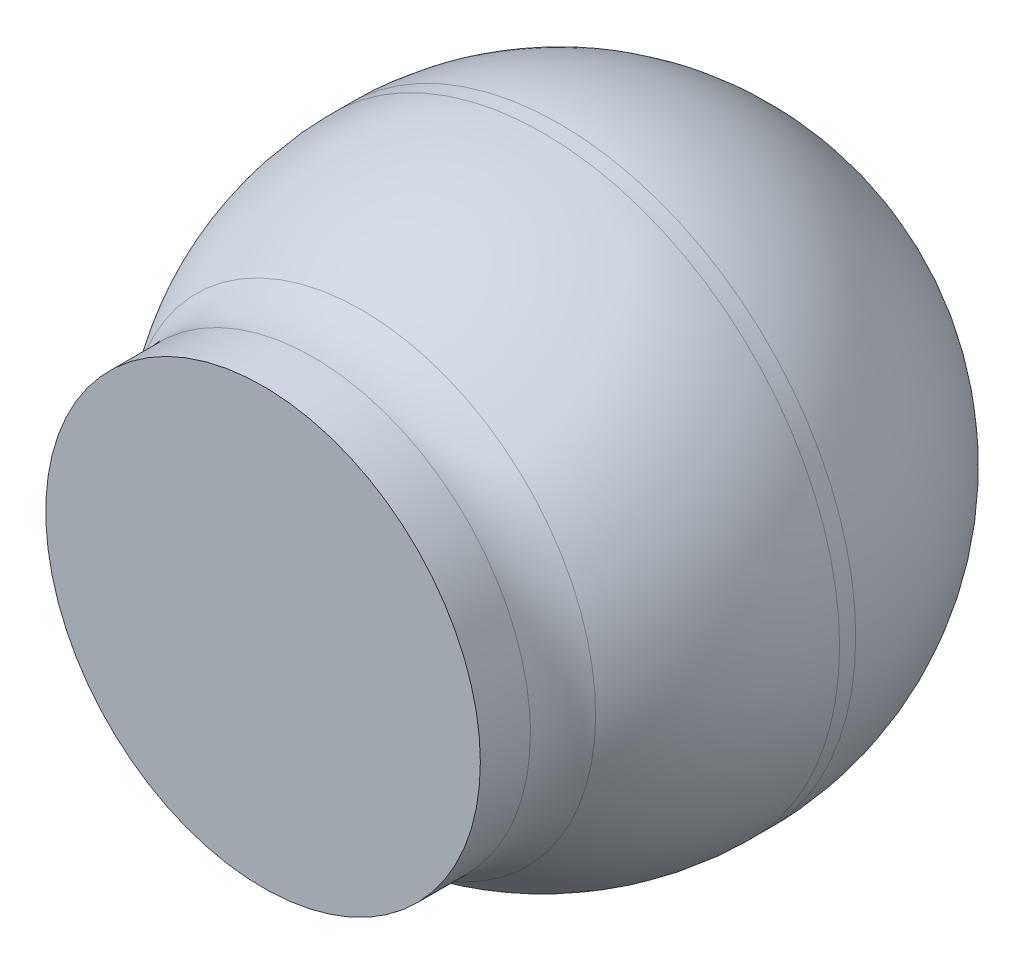
ISO-10303-21;
HEADER;
FILE_DESCRIPTION(('STEP AP214'),'2;1');
FILE_NAME('part.step','',(''),(''),'','','');
FILE_SCHEMA(('AUTOMOTIVE_DESIGN { 1 0 10303 214 1 1 1 1 }'));
ENDSEC;
DATA;
#1=APPLICATION_CONTEXT('core data for automotive mechanical design processes');
#2=APPLICATION_PROTOCOL_DEFINITION('international standard','automotive_design',2000,#1);
#3=PRODUCT_CONTEXT('',#1,'mechanical');
#4=PRODUCT('Part','Part','',(#3));
#5=PRODUCT_RELATED_PRODUCT_CATEGORY('part','',(#4));
#6=PRODUCT_DEFINITION_FORMATION('','',#4);
#7=PRODUCT_DEFINITION_CONTEXT('part definition',#1,'design');
#8=PRODUCT_DEFINITION('design','',#6,#7);
#9=PRODUCT_DEFINITION_SHAPE('','',#8);
#10=(LENGTH_UNIT() NAMED_UNIT(*) SI_UNIT(.MILLI.,.METRE.));
#11=(NAMED_UNIT(*) PLANE_ANGLE_UNIT() SI_UNIT($,.RADIAN.));
#12=(NAMED_UNIT(*) SI_UNIT($,.STERADIAN.) SOLID_ANGLE_UNIT());
#13=UNCERTAINTY_MEASURE_WITH_UNIT(LENGTH_MEASURE(1.E-05),#10,'distance_accuracy_value','');
#14=(GEOMETRIC_REPRESENTATION_CONTEXT(3) GLOBAL_UNCERTAINTY_ASSIGNED_CONTEXT((#13)) GLOBAL_UNIT_ASSIGNED_CONTEXT((#10,
#11,#12)) REPRESENTATION_CONTEXT('',''));
#15=CARTESIAN_POINT('',(0.,0.,0.));
#16=DIRECTION('',(0.,0.,1.));
#17=DIRECTION('',(1.,0.,0.));
#18=AXIS2_PLACEMENT_3D('',#15,#16,#17);
#19=CARTESIAN_POINT('',(-4.372919922269,-6.591349291452,10.006534503384));
#20=DIRECTION('',(0.,0.,-1.));
#21=DIRECTION('',(-1.,0.,0.));
#22=AXIS2_PLACEMENT_3D('',#19,#20,#21);
#23=PLANE('',#22);
#24=CARTESIAN_POINT('',(-4.372919922269,-6.591349291452,10.006534503384));
#25=DIRECTION('',(0.,0.,1.));
#26=DIRECTION('',(1.,0.,0.));
#27=AXIS2_PLACEMENT_3D('',#24,#25,#26);
#28=CIRCLE('',#27,0.275);
#29=CARTESIAN_POINT('',(-4.097919922269,-6.591349291452,10.006534503384));
#30=VERTEX_POINT('',#29);
#31=EDGE_CURVE('E20',#30,#30,#28,.F.);
#32=ORIENTED_EDGE('',*,*,#31,.F.);
#33=EDGE_LOOP('',(#32));
#34=FACE_BOUND('',#33,.T.);
#35=ADVANCED_FACE('F17',(#34),#23,.F.);
#36=CARTESIAN_POINT('',(-4.372919922269,-6.591349291452,9.906534503384));
#37=DIRECTION('',(0.,0.,1.));
#38=DIRECTION('',(1.,0.,0.));
#39=AXIS2_PLACEMENT_3D('',#36,#37,#38);
#40=CYLINDRICAL_SURFACE('',#39,0.275);
#41=CARTESIAN_POINT('',(-4.372919922269,-6.591349291452,9.943180457728));
#42=DIRECTION('',(0.,0.,-1.));
#43=DIRECTION('',(0.996700902337583,0.0811622527992439,0.));
#44=AXIS2_PLACEMENT_3D('',#41,#42,#43);
#45=CIRCLE('',#44,0.275);
#46=CARTESIAN_POINT('',(-4.09882717412617,-6.56902967193221,9.943180457728));
#47=VERTEX_POINT('',#46);
#48=EDGE_CURVE('E65',#47,#47,#45,.F.);
#49=ORIENTED_EDGE('',*,*,#48,.T.);
#50=EDGE_LOOP('',(#49));
#51=FACE_BOUND('',#50,.T.);
#52=ORIENTED_EDGE('',*,*,#31,.T.);
#53=EDGE_LOOP('',(#52));
#54=FACE_BOUND('',#53,.T.);
#55=ADVANCED_FACE('F62',(#51,#54),#40,.T.);
#56=CARTESIAN_POINT('',(-4.372919922269,-6.591349291452,9.943180457728));
#57=DIRECTION('',(0.,0.,-1.));
#58=DIRECTION('',(0.996700902337583,0.0811622527992448,0.));
#59=AXIS2_PLACEMENT_3D('',#56,#57,#58);
#60=TOROIDAL_SURFACE('',#59,0.375,0.1);
#61=ORIENTED_EDGE('',*,*,#48,.F.);
#62=EDGE_LOOP('',(#61));
#63=FACE_BOUND('',#62,.T.);
#64=CARTESIAN_POINT('',(-4.372919922269,-6.591349291452,9.881744931236));
#65=DIRECTION('',(0.,0.,-1.));
#66=DIRECTION('',(-0.996700902337598,-0.0811622527990593,0.));
#67=AXIS2_PLACEMENT_3D('',#64,#65,#66);
#68=CIRCLE('',#67,0.296097046412665);
#69=CARTESIAN_POINT('',(-4.668040115608,-6.615381194786,9.881744931236));
#70=VERTEX_POINT('',#69);
#71=EDGE_CURVE('E39',#70,#70,#68,.T.);
#72=ORIENTED_EDGE('',*,*,#71,.F.);
#73=EDGE_LOOP('',(#72));
#74=FACE_BOUND('',#73,.T.);
#75=ADVANCED_FACE('F57',(#63,#74),#60,.F.);
#76=CARTESIAN_POINT('',(-4.746682760645,-6.621785136252,9.651976062157));
#77=CARTESIAN_POINT('',(-4.746682760645,-6.621785136252,9.701461392103));
#78=CARTESIAN_POINT('',(-4.738526217348,-6.621120941579,9.750947004335));
#79=CARTESIAN_POINT('',(-4.722207085349,-6.619792059952,9.798626332798));
#80=CARTESIAN_POINT('',(-4.698341390838,-6.617848654938,9.842699544317));
#81=CARTESIAN_POINT('',(-4.668040115608,-6.615381194786,9.881744931236));
#82=(BOUNDED_CURVE() B_SPLINE_CURVE(5,(#76,#77,#78,#79,#80,#81),.UNSPECIFIED.,.F.,
.F.) B_SPLINE_CURVE_WITH_KNOTS((6,6),(0.,0.661568582165),
.UNSPECIFIED.) CURVE() GEOMETRIC_REPRESENTATION_ITEM() RATIONAL_B_SPLINE_CURVE((1.,1.,1.,1.,1.,1.)) REPRESENTATION_ITEM(''));
#83=CARTESIAN_POINT('',(-4.372919922269,-6.591349291452,9.651976062157));
#84=DIRECTION('',(0.,0.,-1.));
#85=AXIS1_PLACEMENT('',#83,#84);
#86=SURFACE_OF_REVOLUTION('',#82,#85);
#87=CARTESIAN_POINT('',(-4.372919922269,-6.591349291452,9.651976062157));
#88=DIRECTION('',(0.,0.,1.));
#89=DIRECTION('',(1.,0.,0.));
#90=AXIS2_PLACEMENT_3D('',#87,#88,#89);
#91=CIRCLE('',#90,0.375);
#92=CARTESIAN_POINT('',(-3.997919922269,-6.591349291452,9.651976062157));
#93=VERTEX_POINT('',#92);
#94=EDGE_CURVE('E36',#93,#93,#91,.F.);
#95=ORIENTED_EDGE('',*,*,#94,.F.);
#96=EDGE_LOOP('',(#95));
#97=FACE_BOUND('',#96,.T.);
#98=ORIENTED_EDGE('',*,*,#71,.T.);
#99=EDGE_LOOP('',(#98));
#100=FACE_BOUND('',#99,.T.);
#101=ADVANCED_FACE('F53',(#97,#100),#86,.F.);
#102=CARTESIAN_POINT('',(-4.372919922269,-6.591349291452,9.256534503384));
#103=DIRECTION('',(0.,0.,1.));
#104=DIRECTION('',(1.,0.,0.));
#105=AXIS2_PLACEMENT_3D('',#102,#103,#104);
#106=CYLINDRICAL_SURFACE('',#105,0.375);
#107=CARTESIAN_POINT('',(-4.372919922269,-6.591349291452,9.631534503384));
#108=DIRECTION('',(0.,0.,-1.));
#109=DIRECTION('',(0.0811622527992357,-0.996700902337583,0.));
#110=AXIS2_PLACEMENT_3D('',#107,#108,#109);
#111=CIRCLE('',#110,0.375);
#112=CARTESIAN_POINT('',(-4.34248407746929,-6.96511212982859,9.631534503384));
#113=VERTEX_POINT('',#112);
#114=CARTESIAN_POINT('',(-4.40335576706871,-6.21758645307541,9.631534503384));
#115=VERTEX_POINT('',#114);
#116=EDGE_CURVE('E11',#113,#115,#111,.T.);
#117=ORIENTED_EDGE('',*,*,#116,.F.);
#118=CARTESIAN_POINT('',(-4.372919922269,-6.591349291452,9.631534503384));
#119=DIRECTION('',(0.,0.,1.));
#120=DIRECTION('',(0.0811622527992365,-0.996700902337583,0.));
#121=AXIS2_PLACEMENT_3D('',#118,#119,#120);
#122=CIRCLE('',#121,0.375);
#123=EDGE_CURVE('E25',#115,#113,#122,.F.);
#124=ORIENTED_EDGE('',*,*,#123,.F.);
#125=EDGE_LOOP('',(#117,#124));
#126=FACE_BOUND('',#125,.T.);
#127=ORIENTED_EDGE('',*,*,#94,.T.);
#128=EDGE_LOOP('',(#127));
#129=FACE_BOUND('',#128,.T.);
#130=ADVANCED_FACE('F34',(#126,#129),#106,.T.);
#131=CARTESIAN_POINT('',(-4.372919922269,-6.591349291452,9.631534503384));
#132=DIRECTION('',(0.0811622527992361,-0.996700902337583,0.));
#133=DIRECTION('',(-0.996700902337583,-0.0811622527992361,0.));
#134=AXIS2_PLACEMENT_3D('',#131,#132,#133);
#135=SPHERICAL_SURFACE('',#134,0.375);
#136=ORIENTED_EDGE('',*,*,#123,.T.);
#137=ORIENTED_EDGE('',*,*,#116,.T.);
#138=EDGE_LOOP('',(#136,#137));
#139=FACE_BOUND('',#138,.T.);
#140=ADVANCED_FACE('F32',(#139),#135,.T.);
#141=CLOSED_SHELL('',(#35,#55,#75,#101,#130,#140));
#142=MANIFOLD_SOLID_BREP('B1',#141);
#143=ADVANCED_BREP_SHAPE_REPRESENTATION('',(#18,#142),#14);
#144=SHAPE_DEFINITION_REPRESENTATION(#9,#143);
ENDSEC;
END-ISO-10303-21;
